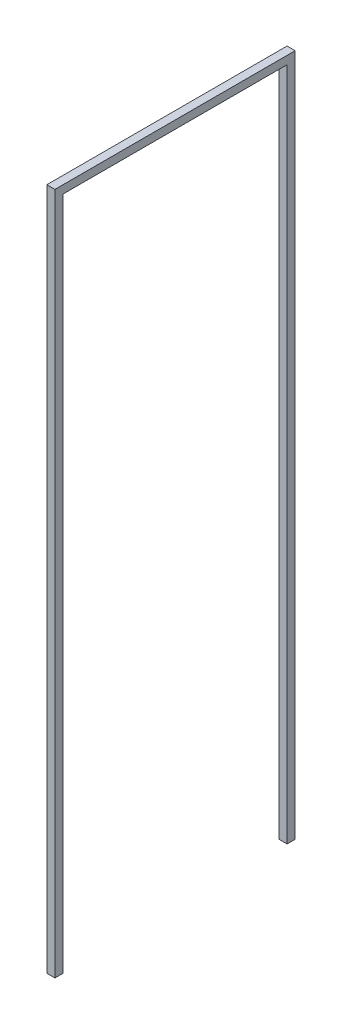
ISO-10303-21;
HEADER;
FILE_DESCRIPTION(('STEP AP214'),'2;1');
FILE_NAME('part.step','',(''),(''),'','','');
FILE_SCHEMA(('AUTOMOTIVE_DESIGN { 1 0 10303 214 1 1 1 1 }'));
ENDSEC;
DATA;
#1=APPLICATION_CONTEXT('core data for automotive mechanical design processes');
#2=APPLICATION_PROTOCOL_DEFINITION('international standard','automotive_design',2000,#1);
#3=PRODUCT_CONTEXT('',#1,'mechanical');
#4=PRODUCT('Part','Part','',(#3));
#5=PRODUCT_RELATED_PRODUCT_CATEGORY('part','',(#4));
#6=PRODUCT_DEFINITION_FORMATION('','',#4);
#7=PRODUCT_DEFINITION_CONTEXT('part definition',#1,'design');
#8=PRODUCT_DEFINITION('design','',#6,#7);
#9=PRODUCT_DEFINITION_SHAPE('','',#8);
#10=(LENGTH_UNIT() NAMED_UNIT(*) SI_UNIT(.MILLI.,.METRE.));
#11=(NAMED_UNIT(*) PLANE_ANGLE_UNIT() SI_UNIT($,.RADIAN.));
#12=(NAMED_UNIT(*) SI_UNIT($,.STERADIAN.) SOLID_ANGLE_UNIT());
#13=UNCERTAINTY_MEASURE_WITH_UNIT(LENGTH_MEASURE(1.E-05),#10,'distance_accuracy_value','');
#14=(GEOMETRIC_REPRESENTATION_CONTEXT(3) GLOBAL_UNCERTAINTY_ASSIGNED_CONTEXT((#13)) GLOBAL_UNIT_ASSIGNED_CONTEXT((#10,
#11,#12)) REPRESENTATION_CONTEXT('',''));
#15=CARTESIAN_POINT('',(0.,0.,0.));
#16=DIRECTION('',(0.,0.,1.));
#17=DIRECTION('',(1.,0.,0.));
#18=AXIS2_PLACEMENT_3D('',#15,#16,#17);
#19=CARTESIAN_POINT('',(15.,0.,-890.));
#20=DIRECTION('',(0.,-1.,0.));
#21=DIRECTION('',(0.,0.,-1.));
#22=AXIS2_PLACEMENT_3D('',#19,#20,#21);
#23=PLANE('',#22);
#24=DIRECTION('',(0.,0.,1.));
#25=VECTOR('',#24,1.);
#26=CARTESIAN_POINT('',(-15.,0.,-890.));
#27=LINE('',#26,#25);
#28=CARTESIAN_POINT('',(-15.,0.,-890.));
#29=VERTEX_POINT('',#28);
#30=CARTESIAN_POINT('',(-15.,0.,-860.));
#31=VERTEX_POINT('',#30);
#32=EDGE_CURVE('E151',#29,#31,#27,.T.);
#33=ORIENTED_EDGE('',*,*,#32,.F.);
#34=DIRECTION('',(-1.,0.,0.));
#35=VECTOR('',#34,1.);
#36=CARTESIAN_POINT('',(15.,0.,-890.));
#37=LINE('',#36,#35);
#38=CARTESIAN_POINT('',(15.,0.,-890.));
#39=VERTEX_POINT('',#38);
#40=EDGE_CURVE('E43',#39,#29,#37,.T.);
#41=ORIENTED_EDGE('',*,*,#40,.F.);
#42=DIRECTION('',(0.,0.,1.));
#43=VECTOR('',#42,1.);
#44=CARTESIAN_POINT('',(15.,0.,-890.));
#45=LINE('',#44,#43);
#46=CARTESIAN_POINT('',(15.,0.,-860.));
#47=VERTEX_POINT('',#46);
#48=EDGE_CURVE('E122',#39,#47,#45,.T.);
#49=ORIENTED_EDGE('',*,*,#48,.T.);
#50=DIRECTION('',(-1.,0.,0.));
#51=VECTOR('',#50,1.);
#52=CARTESIAN_POINT('',(15.,0.,-860.));
#53=LINE('',#52,#51);
#54=EDGE_CURVE('E11',#47,#31,#53,.T.);
#55=ORIENTED_EDGE('',*,*,#54,.T.);
#56=EDGE_LOOP('',(#33,#41,#49,#55));
#57=FACE_BOUND('',#56,.T.);
#58=CARTESIAN_POINT('',(0.,0.,-875.));
#59=DIRECTION('',(0.,-1.,0.));
#60=DIRECTION('',(0.,0.,-1.));
#61=AXIS2_PLACEMENT_3D('',#58,#59,#60);
#62=CIRCLE('',#61,2.5);
#63=CARTESIAN_POINT('',(0.,0.,-877.5));
#64=VERTEX_POINT('',#63);
#65=EDGE_CURVE('E37',#64,#64,#62,.F.);
#66=ORIENTED_EDGE('',*,*,#65,.T.);
#67=EDGE_LOOP('',(#66));
#68=FACE_BOUND('',#67,.T.);
#69=ADVANCED_FACE('F33',(#57,#68),#23,.T.);
#70=CARTESIAN_POINT('',(15.,0.,-30.));
#71=DIRECTION('',(0.,-1.,0.));
#72=DIRECTION('',(0.,0.,-1.));
#73=AXIS2_PLACEMENT_3D('',#70,#71,#72);
#74=PLANE('',#73);
#75=DIRECTION('',(0.,0.,1.));
#76=VECTOR('',#75,1.);
#77=CARTESIAN_POINT('',(-15.,0.,-30.));
#78=LINE('',#77,#76);
#79=CARTESIAN_POINT('',(-15.,0.,-30.));
#80=VERTEX_POINT('',#79);
#81=CARTESIAN_POINT('',(-15.,0.,0.));
#82=VERTEX_POINT('',#81);
#83=EDGE_CURVE('E142',#80,#82,#78,.T.);
#84=ORIENTED_EDGE('',*,*,#83,.F.);
#85=DIRECTION('',(-1.,0.,0.));
#86=VECTOR('',#85,1.);
#87=CARTESIAN_POINT('',(15.,0.,-30.));
#88=LINE('',#87,#86);
#89=CARTESIAN_POINT('',(15.,0.,-30.));
#90=VERTEX_POINT('',#89);
#91=EDGE_CURVE('E159',#90,#80,#88,.T.);
#92=ORIENTED_EDGE('',*,*,#91,.F.);
#93=DIRECTION('',(0.,0.,1.));
#94=VECTOR('',#93,1.);
#95=CARTESIAN_POINT('',(15.,0.,-30.));
#96=LINE('',#95,#94);
#97=CARTESIAN_POINT('',(15.,0.,0.));
#98=VERTEX_POINT('',#97);
#99=EDGE_CURVE('E127',#90,#98,#96,.T.);
#100=ORIENTED_EDGE('',*,*,#99,.T.);
#101=DIRECTION('',(-1.,0.,0.));
#102=VECTOR('',#101,1.);
#103=CARTESIAN_POINT('',(15.,0.,0.));
#104=LINE('',#103,#102);
#105=EDGE_CURVE('E157',#98,#82,#104,.T.);
#106=ORIENTED_EDGE('',*,*,#105,.T.);
#107=EDGE_LOOP('',(#84,#92,#100,#106));
#108=FACE_BOUND('',#107,.T.);
#109=CARTESIAN_POINT('',(0.,0.,-15.));
#110=DIRECTION('',(0.,-1.,0.));
#111=DIRECTION('',(0.,0.,-1.));
#112=AXIS2_PLACEMENT_3D('',#109,#110,#111);
#113=CIRCLE('',#112,2.5);
#114=CARTESIAN_POINT('',(0.,0.,-17.5));
#115=VERTEX_POINT('',#114);
#116=EDGE_CURVE('E136',#115,#115,#113,.F.);
#117=ORIENTED_EDGE('',*,*,#116,.T.);
#118=EDGE_LOOP('',(#117));
#119=FACE_BOUND('',#118,.T.);
#120=ADVANCED_FACE('F184',(#108,#119),#74,.T.);
#121=CARTESIAN_POINT('',(15.,0.,-860.));
#122=DIRECTION('',(0.,0.,1.));
#123=DIRECTION('',(0.,-1.,0.));
#124=AXIS2_PLACEMENT_3D('',#121,#122,#123);
#125=PLANE('',#124);
#126=DIRECTION('',(0.,1.,0.));
#127=VECTOR('',#126,1.);
#128=CARTESIAN_POINT('',(-15.,0.,-860.));
#129=LINE('',#128,#127);
#130=CARTESIAN_POINT('',(-15.,2500.,-860.));
#131=VERTEX_POINT('',#130);
#132=EDGE_CURVE('E132',#31,#131,#129,.T.);
#133=ORIENTED_EDGE('',*,*,#132,.F.);
#134=ORIENTED_EDGE('',*,*,#54,.F.);
#135=DIRECTION('',(0.,1.,0.));
#136=VECTOR('',#135,1.);
#137=CARTESIAN_POINT('',(15.,0.,-860.));
#138=LINE('',#137,#136);
#139=CARTESIAN_POINT('',(15.,2500.,-860.));
#140=VERTEX_POINT('',#139);
#141=EDGE_CURVE('E153',#47,#140,#138,.T.);
#142=ORIENTED_EDGE('',*,*,#141,.T.);
#143=DIRECTION('',(-1.,0.,0.));
#144=VECTOR('',#143,1.);
#145=CARTESIAN_POINT('',(15.,2500.,-860.));
#146=LINE('',#145,#144);
#147=EDGE_CURVE('E90',#140,#131,#146,.T.);
#148=ORIENTED_EDGE('',*,*,#147,.T.);
#149=EDGE_LOOP('',(#133,#134,#142,#148));
#150=FACE_BOUND('',#149,.T.);
#151=ADVANCED_FACE('F35',(#150),#125,.T.);
#152=CARTESIAN_POINT('',(15.,2530.,-889.999999999999));
#153=DIRECTION('',(0.,0.,-1.));
#154=DIRECTION('',(0.,1.,0.));
#155=AXIS2_PLACEMENT_3D('',#152,#153,#154);
#156=PLANE('',#155);
#157=DIRECTION('',(0.,-1.,0.));
#158=VECTOR('',#157,1.);
#159=CARTESIAN_POINT('',(-15.,2530.,-889.999999999999));
#160=LINE('',#159,#158);
#161=CARTESIAN_POINT('',(-15.,2530.,-889.999999999999));
#162=VERTEX_POINT('',#161);
#163=EDGE_CURVE('E109',#162,#29,#160,.T.);
#164=ORIENTED_EDGE('',*,*,#163,.F.);
#165=DIRECTION('',(-1.,0.,0.));
#166=VECTOR('',#165,1.);
#167=CARTESIAN_POINT('',(15.,2530.,-889.999999999999));
#168=LINE('',#167,#166);
#169=CARTESIAN_POINT('',(15.,2530.,-889.999999999999));
#170=VERTEX_POINT('',#169);
#171=EDGE_CURVE('E104',#170,#162,#168,.T.);
#172=ORIENTED_EDGE('',*,*,#171,.F.);
#173=DIRECTION('',(0.,-1.,0.));
#174=VECTOR('',#173,1.);
#175=CARTESIAN_POINT('',(15.,2530.,-889.999999999999));
#176=LINE('',#175,#174);
#177=EDGE_CURVE('E107',#170,#39,#176,.T.);
#178=ORIENTED_EDGE('',*,*,#177,.T.);
#179=ORIENTED_EDGE('',*,*,#40,.T.);
#180=EDGE_LOOP('',(#164,#172,#178,#179));
#181=FACE_BOUND('',#180,.T.);
#182=ADVANCED_FACE('F106',(#181),#156,.T.);
#183=CARTESIAN_POINT('',(15.,2530.,0.));
#184=DIRECTION('',(0.,1.,0.));
#185=DIRECTION('',(0.,0.,1.));
#186=AXIS2_PLACEMENT_3D('',#183,#184,#185);
#187=PLANE('',#186);
#188=DIRECTION('',(0.,0.,-1.));
#189=VECTOR('',#188,1.);
#190=CARTESIAN_POINT('',(-15.,2530.,0.));
#191=LINE('',#190,#189);
#192=CARTESIAN_POINT('',(-15.,2530.,0.));
#193=VERTEX_POINT('',#192);
#194=EDGE_CURVE('E148',#193,#162,#191,.T.);
#195=ORIENTED_EDGE('',*,*,#194,.F.);
#196=DIRECTION('',(-1.,0.,0.));
#197=VECTOR('',#196,1.);
#198=CARTESIAN_POINT('',(15.,2530.,0.));
#199=LINE('',#198,#197);
#200=CARTESIAN_POINT('',(15.,2530.,0.));
#201=VERTEX_POINT('',#200);
#202=EDGE_CURVE('E114',#201,#193,#199,.T.);
#203=ORIENTED_EDGE('',*,*,#202,.F.);
#204=DIRECTION('',(0.,0.,-1.));
#205=VECTOR('',#204,1.);
#206=CARTESIAN_POINT('',(15.,2530.,0.));
#207=LINE('',#206,#205);
#208=EDGE_CURVE('E120',#201,#170,#207,.T.);
#209=ORIENTED_EDGE('',*,*,#208,.T.);
#210=ORIENTED_EDGE('',*,*,#171,.T.);
#211=EDGE_LOOP('',(#195,#203,#209,#210));
#212=FACE_BOUND('',#211,.T.);
#213=ADVANCED_FACE('F124',(#212),#187,.T.);
#214=CARTESIAN_POINT('',(15.,0.,0.));
#215=DIRECTION('',(0.,0.,1.));
#216=DIRECTION('',(1.,0.,0.));
#217=AXIS2_PLACEMENT_3D('',#214,#215,#216);
#218=PLANE('',#217);
#219=DIRECTION('',(0.,1.,0.));
#220=VECTOR('',#219,1.);
#221=CARTESIAN_POINT('',(-15.,0.,0.));
#222=LINE('',#221,#220);
#223=EDGE_CURVE('E145',#82,#193,#222,.T.);
#224=ORIENTED_EDGE('',*,*,#223,.F.);
#225=ORIENTED_EDGE('',*,*,#105,.F.);
#226=DIRECTION('',(0.,1.,0.));
#227=VECTOR('',#226,1.);
#228=CARTESIAN_POINT('',(15.,0.,0.));
#229=LINE('',#228,#227);
#230=EDGE_CURVE('E125',#98,#201,#229,.T.);
#231=ORIENTED_EDGE('',*,*,#230,.T.);
#232=ORIENTED_EDGE('',*,*,#202,.T.);
#233=EDGE_LOOP('',(#224,#225,#231,#232));
#234=FACE_BOUND('',#233,.T.);
#235=ADVANCED_FACE('F226',(#234),#218,.T.);
#236=CARTESIAN_POINT('',(15.,2500.,-29.9999999999997));
#237=DIRECTION('',(0.,0.,-1.));
#238=DIRECTION('',(0.,1.,0.));
#239=AXIS2_PLACEMENT_3D('',#236,#237,#238);
#240=PLANE('',#239);
#241=DIRECTION('',(0.,-1.,0.));
#242=VECTOR('',#241,1.);
#243=CARTESIAN_POINT('',(-15.,2500.,-29.9999999999997));
#244=LINE('',#243,#242);
#245=CARTESIAN_POINT('',(-15.,2500.,-29.9999999999997));
#246=VERTEX_POINT('',#245);
#247=EDGE_CURVE('E139',#246,#80,#244,.T.);
#248=ORIENTED_EDGE('',*,*,#247,.F.);
#249=DIRECTION('',(-1.,0.,0.));
#250=VECTOR('',#249,1.);
#251=CARTESIAN_POINT('',(15.,2500.,-29.9999999999997));
#252=LINE('',#251,#250);
#253=CARTESIAN_POINT('',(15.,2500.,-29.9999999999997));
#254=VERTEX_POINT('',#253);
#255=EDGE_CURVE('E161',#254,#246,#252,.T.);
#256=ORIENTED_EDGE('',*,*,#255,.F.);
#257=DIRECTION('',(0.,-1.,0.));
#258=VECTOR('',#257,1.);
#259=CARTESIAN_POINT('',(15.,2500.,-29.9999999999997));
#260=LINE('',#259,#258);
#261=EDGE_CURVE('E178',#254,#90,#260,.T.);
#262=ORIENTED_EDGE('',*,*,#261,.T.);
#263=ORIENTED_EDGE('',*,*,#91,.T.);
#264=EDGE_LOOP('',(#248,#256,#262,#263));
#265=FACE_BOUND('',#264,.T.);
#266=ADVANCED_FACE('F189',(#265),#240,.T.);
#267=CARTESIAN_POINT('',(15.,2500.,-860.));
#268=DIRECTION('',(0.,-1.,0.));
#269=DIRECTION('',(0.,0.,-1.));
#270=AXIS2_PLACEMENT_3D('',#267,#268,#269);
#271=PLANE('',#270);
#272=DIRECTION('',(0.,0.,1.));
#273=VECTOR('',#272,1.);
#274=CARTESIAN_POINT('',(-15.,2500.,-860.));
#275=LINE('',#274,#273);
#276=EDGE_CURVE('E135',#131,#246,#275,.T.);
#277=ORIENTED_EDGE('',*,*,#276,.F.);
#278=ORIENTED_EDGE('',*,*,#147,.F.);
#279=DIRECTION('',(0.,0.,1.));
#280=VECTOR('',#279,1.);
#281=CARTESIAN_POINT('',(15.,2500.,-860.));
#282=LINE('',#281,#280);
#283=EDGE_CURVE('E176',#140,#254,#282,.T.);
#284=ORIENTED_EDGE('',*,*,#283,.T.);
#285=ORIENTED_EDGE('',*,*,#255,.T.);
#286=EDGE_LOOP('',(#277,#278,#284,#285));
#287=FACE_BOUND('',#286,.T.);
#288=ADVANCED_FACE('F190',(#287),#271,.T.);
#289=CARTESIAN_POINT('',(15.,0.,0.));
#290=DIRECTION('',(1.,0.,0.));
#291=DIRECTION('',(0.,0.,-1.));
#292=AXIS2_PLACEMENT_3D('',#289,#290,#291);
#293=PLANE('',#292);
#294=ORIENTED_EDGE('',*,*,#141,.F.);
#295=ORIENTED_EDGE('',*,*,#48,.F.);
#296=ORIENTED_EDGE('',*,*,#177,.F.);
#297=ORIENTED_EDGE('',*,*,#208,.F.);
#298=ORIENTED_EDGE('',*,*,#230,.F.);
#299=ORIENTED_EDGE('',*,*,#99,.F.);
#300=ORIENTED_EDGE('',*,*,#261,.F.);
#301=ORIENTED_EDGE('',*,*,#283,.F.);
#302=EDGE_LOOP('',(#294,#295,#296,#297,#298,#299,#300,#301));
#303=FACE_BOUND('',#302,.T.);
#304=ADVANCED_FACE('F118',(#303),#293,.T.);
#305=CARTESIAN_POINT('',(-15.,0.,0.));
#306=DIRECTION('',(1.,0.,0.));
#307=DIRECTION('',(0.,0.,-1.));
#308=AXIS2_PLACEMENT_3D('',#305,#306,#307);
#309=PLANE('',#308);
#310=ORIENTED_EDGE('',*,*,#132,.T.);
#311=ORIENTED_EDGE('',*,*,#276,.T.);
#312=ORIENTED_EDGE('',*,*,#247,.T.);
#313=ORIENTED_EDGE('',*,*,#83,.T.);
#314=ORIENTED_EDGE('',*,*,#223,.T.);
#315=ORIENTED_EDGE('',*,*,#194,.T.);
#316=ORIENTED_EDGE('',*,*,#163,.T.);
#317=ORIENTED_EDGE('',*,*,#32,.T.);
#318=EDGE_LOOP('',(#310,#311,#312,#313,#314,#315,#316,#317));
#319=FACE_BOUND('',#318,.T.);
#320=ADVANCED_FACE('F192',(#319),#309,.F.);
#321=CARTESIAN_POINT('',(0.,-2.5,-15.));
#322=DIRECTION('',(0.,1.,0.));
#323=DIRECTION('',(0.,0.,1.));
#324=AXIS2_PLACEMENT_3D('',#321,#322,#323);
#325=CYLINDRICAL_SURFACE('',#324,2.5);
#326=ORIENTED_EDGE('',*,*,#116,.F.);
#327=EDGE_LOOP('',(#326));
#328=FACE_BOUND('',#327,.T.);
#329=CARTESIAN_POINT('',(0.,-2.5,-15.));
#330=DIRECTION('',(0.,-1.,0.));
#331=DIRECTION('',(0.,0.,-1.));
#332=AXIS2_PLACEMENT_3D('',#329,#330,#331);
#333=CIRCLE('',#332,2.5);
#334=CARTESIAN_POINT('',(0.,-2.5,-17.5));
#335=VERTEX_POINT('',#334);
#336=EDGE_CURVE('E164',#335,#335,#333,.T.);
#337=ORIENTED_EDGE('',*,*,#336,.F.);
#338=EDGE_LOOP('',(#337));
#339=FACE_BOUND('',#338,.T.);
#340=ADVANCED_FACE('F214',(#328,#339),#325,.T.);
#341=CARTESIAN_POINT('',(0.,-2.5,-15.));
#342=DIRECTION('',(0.,-1.,0.));
#343=DIRECTION('',(0.,0.,-1.));
#344=AXIS2_PLACEMENT_3D('',#341,#342,#343);
#345=PLANE('',#344);
#346=ORIENTED_EDGE('',*,*,#336,.T.);
#347=EDGE_LOOP('',(#346));
#348=FACE_BOUND('',#347,.T.);
#349=ADVANCED_FACE('F202',(#348),#345,.T.);
#350=CARTESIAN_POINT('',(0.,-2.5,-875.));
#351=DIRECTION('',(0.,1.,0.));
#352=DIRECTION('',(0.,0.,1.));
#353=AXIS2_PLACEMENT_3D('',#350,#351,#352);
#354=CYLINDRICAL_SURFACE('',#353,2.5);
#355=ORIENTED_EDGE('',*,*,#65,.F.);
#356=EDGE_LOOP('',(#355));
#357=FACE_BOUND('',#356,.T.);
#358=CARTESIAN_POINT('',(0.,-2.5,-875.));
#359=DIRECTION('',(0.,-1.,0.));
#360=DIRECTION('',(0.,0.,-1.));
#361=AXIS2_PLACEMENT_3D('',#358,#359,#360);
#362=CIRCLE('',#361,2.5);
#363=CARTESIAN_POINT('',(0.,-2.5,-877.5));
#364=VERTEX_POINT('',#363);
#365=EDGE_CURVE('E172',#364,#364,#362,.T.);
#366=ORIENTED_EDGE('',*,*,#365,.F.);
#367=EDGE_LOOP('',(#366));
#368=FACE_BOUND('',#367,.T.);
#369=ADVANCED_FACE('F198',(#357,#368),#354,.T.);
#370=CARTESIAN_POINT('',(0.,-2.5,-875.));
#371=DIRECTION('',(0.,-1.,0.));
#372=DIRECTION('',(0.,0.,-1.));
#373=AXIS2_PLACEMENT_3D('',#370,#371,#372);
#374=PLANE('',#373);
#375=ORIENTED_EDGE('',*,*,#365,.T.);
#376=EDGE_LOOP('',(#375));
#377=FACE_BOUND('',#376,.T.);
#378=ADVANCED_FACE('F201',(#377),#374,.T.);
#379=CLOSED_SHELL('',(#69,#120,#151,#182,#213,#235,#266,#288,#304,#320,#340,#349,#369,#378));
#380=MANIFOLD_SOLID_BREP('B2',#379);
#381=ADVANCED_BREP_SHAPE_REPRESENTATION('',(#18,#380),#14);
#382=SHAPE_DEFINITION_REPRESENTATION(#9,#381);
ENDSEC;
END-ISO-10303-21;
